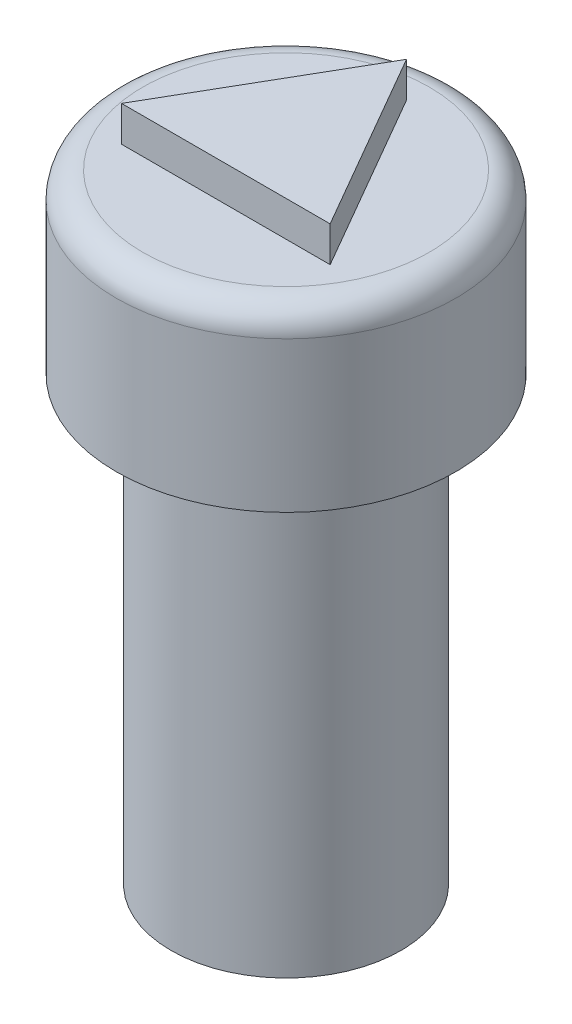
ISO-10303-21;
HEADER;
FILE_DESCRIPTION(('STEP AP214'),'2;1');
FILE_NAME('part.step','',(''),(''),'','','');
FILE_SCHEMA(('AUTOMOTIVE_DESIGN { 1 0 10303 214 1 1 1 1 }'));
ENDSEC;
DATA;
#1=APPLICATION_CONTEXT('core data for automotive mechanical design processes');
#2=APPLICATION_PROTOCOL_DEFINITION('international standard','automotive_design',2000,#1);
#3=PRODUCT_CONTEXT('',#1,'mechanical');
#4=PRODUCT('Part','Part','',(#3));
#5=PRODUCT_RELATED_PRODUCT_CATEGORY('part','',(#4));
#6=PRODUCT_DEFINITION_FORMATION('','',#4);
#7=PRODUCT_DEFINITION_CONTEXT('part definition',#1,'design');
#8=PRODUCT_DEFINITION('design','',#6,#7);
#9=PRODUCT_DEFINITION_SHAPE('','',#8);
#10=(LENGTH_UNIT() NAMED_UNIT(*) SI_UNIT(.MILLI.,.METRE.));
#11=(NAMED_UNIT(*) PLANE_ANGLE_UNIT() SI_UNIT($,.RADIAN.));
#12=(NAMED_UNIT(*) SI_UNIT($,.STERADIAN.) SOLID_ANGLE_UNIT());
#13=UNCERTAINTY_MEASURE_WITH_UNIT(LENGTH_MEASURE(1.E-05),#10,'distance_accuracy_value','');
#14=(GEOMETRIC_REPRESENTATION_CONTEXT(3) GLOBAL_UNCERTAINTY_ASSIGNED_CONTEXT((#13)) GLOBAL_UNIT_ASSIGNED_CONTEXT((#10,
#11,#12)) REPRESENTATION_CONTEXT('',''));
#15=CARTESIAN_POINT('',(0.,0.,0.));
#16=DIRECTION('',(0.,0.,1.));
#17=DIRECTION('',(1.,0.,0.));
#18=AXIS2_PLACEMENT_3D('',#15,#16,#17);
#19=CARTESIAN_POINT('',(0.,12.5,0.));
#20=DIRECTION('',(0.,-1.,0.));
#21=DIRECTION('',(0.,0.,-1.));
#22=AXIS2_PLACEMENT_3D('',#19,#20,#21);
#23=CYLINDRICAL_SURFACE('',#22,3.25);
#24=CARTESIAN_POINT('',(0.,12.5,0.));
#25=DIRECTION('',(0.,1.,0.));
#26=DIRECTION('',(0.,0.,1.));
#27=AXIS2_PLACEMENT_3D('',#24,#25,#26);
#28=CIRCLE('',#27,3.25);
#29=CARTESIAN_POINT('',(0.,12.5,3.25));
#30=VERTEX_POINT('',#29);
#31=EDGE_CURVE('E159',#30,#30,#28,.T.);
#32=ORIENTED_EDGE('',*,*,#31,.F.);
#33=EDGE_LOOP('',(#32));
#34=FACE_BOUND('',#33,.T.);
#35=CARTESIAN_POINT('',(0.,0.,0.));
#36=DIRECTION('',(0.,1.,0.));
#37=DIRECTION('',(0.,0.,1.));
#38=AXIS2_PLACEMENT_3D('',#35,#36,#37);
#39=CIRCLE('',#38,3.25);
#40=CARTESIAN_POINT('',(0.,0.,3.25));
#41=VERTEX_POINT('',#40);
#42=EDGE_CURVE('E155',#41,#41,#39,.T.);
#43=ORIENTED_EDGE('',*,*,#42,.T.);
#44=EDGE_LOOP('',(#43));
#45=FACE_BOUND('',#44,.T.);
#46=ADVANCED_FACE('F83',(#34,#45),#23,.T.);
#47=CARTESIAN_POINT('',(0.,0.,0.));
#48=DIRECTION('',(0.,1.,0.));
#49=DIRECTION('',(0.,0.,1.));
#50=AXIS2_PLACEMENT_3D('',#47,#48,#49);
#51=PLANE('',#50);
#52=CARTESIAN_POINT('',(0.,0.,0.));
#53=DIRECTION('',(0.,-1.,0.));
#54=DIRECTION('',(0.,0.,-1.));
#55=AXIS2_PLACEMENT_3D('',#52,#53,#54);
#56=CIRCLE('',#55,1.75);
#57=CARTESIAN_POINT('',(0.,0.,-1.75));
#58=VERTEX_POINT('',#57);
#59=EDGE_CURVE('E145',#58,#58,#56,.T.);
#60=ORIENTED_EDGE('',*,*,#59,.F.);
#61=EDGE_LOOP('',(#60));
#62=FACE_BOUND('',#61,.T.);
#63=ORIENTED_EDGE('',*,*,#42,.F.);
#64=EDGE_LOOP('',(#63));
#65=FACE_BOUND('',#64,.T.);
#66=ADVANCED_FACE('F181',(#62,#65),#51,.F.);
#67=CARTESIAN_POINT('',(0.,2.5,0.));
#68=DIRECTION('',(0.,-1.,0.));
#69=DIRECTION('',(0.,0.,-1.));
#70=AXIS2_PLACEMENT_3D('',#67,#68,#69);
#71=CYLINDRICAL_SURFACE('',#70,1.75);
#72=CARTESIAN_POINT('',(0.,2.5,0.));
#73=DIRECTION('',(0.,-1.,0.));
#74=DIRECTION('',(0.,0.,-1.));
#75=AXIS2_PLACEMENT_3D('',#72,#73,#74);
#76=CIRCLE('',#75,1.75);
#77=CARTESIAN_POINT('',(0.,2.5,-1.75));
#78=VERTEX_POINT('',#77);
#79=EDGE_CURVE('E151',#78,#78,#76,.T.);
#80=ORIENTED_EDGE('',*,*,#79,.F.);
#81=EDGE_LOOP('',(#80));
#82=FACE_BOUND('',#81,.T.);
#83=ORIENTED_EDGE('',*,*,#59,.T.);
#84=EDGE_LOOP('',(#83));
#85=FACE_BOUND('',#84,.T.);
#86=ADVANCED_FACE('F186',(#82,#85),#71,.F.);
#87=CARTESIAN_POINT('',(0.,2.5,0.));
#88=DIRECTION('',(0.,-1.,0.));
#89=DIRECTION('',(0.,0.,-1.));
#90=AXIS2_PLACEMENT_3D('',#87,#88,#89);
#91=PLANE('',#90);
#92=ORIENTED_EDGE('',*,*,#79,.T.);
#93=EDGE_LOOP('',(#92));
#94=FACE_BOUND('',#93,.T.);
#95=ADVANCED_FACE('F194',(#94),#91,.T.);
#96=CARTESIAN_POINT('',(0.,17.5,0.));
#97=DIRECTION('',(0.,-1.,0.));
#98=DIRECTION('',(0.,0.,-1.));
#99=AXIS2_PLACEMENT_3D('',#96,#97,#98);
#100=CYLINDRICAL_SURFACE('',#99,4.8);
#101=CARTESIAN_POINT('',(0.,16.75,0.));
#102=DIRECTION('',(0.,1.,0.));
#103=DIRECTION('',(0.,0.,1.));
#104=AXIS2_PLACEMENT_3D('',#101,#102,#103);
#105=CIRCLE('',#104,4.8);
#106=CARTESIAN_POINT('',(0.,16.75,4.8));
#107=VERTEX_POINT('',#106);
#108=EDGE_CURVE('E12',#107,#107,#105,.F.);
#109=ORIENTED_EDGE('',*,*,#108,.T.);
#110=EDGE_LOOP('',(#109));
#111=FACE_BOUND('',#110,.T.);
#112=CARTESIAN_POINT('',(0.,12.5,0.));
#113=DIRECTION('',(0.,1.,0.));
#114=DIRECTION('',(0.,0.,1.));
#115=AXIS2_PLACEMENT_3D('',#112,#113,#114);
#116=CIRCLE('',#115,4.8);
#117=CARTESIAN_POINT('',(0.,12.5,4.8));
#118=VERTEX_POINT('',#117);
#119=EDGE_CURVE('E140',#118,#118,#116,.T.);
#120=ORIENTED_EDGE('',*,*,#119,.T.);
#121=EDGE_LOOP('',(#120));
#122=FACE_BOUND('',#121,.T.);
#123=ADVANCED_FACE('F198',(#111,#122),#100,.T.);
#124=CARTESIAN_POINT('',(0.,17.5,0.));
#125=DIRECTION('',(0.,1.,0.));
#126=DIRECTION('',(0.,0.,1.));
#127=AXIS2_PLACEMENT_3D('',#124,#125,#126);
#128=PLANE('',#127);
#129=CARTESIAN_POINT('',(0.,17.5,0.));
#130=DIRECTION('',(0.,1.,0.));
#131=DIRECTION('',(0.,0.,1.));
#132=AXIS2_PLACEMENT_3D('',#129,#130,#131);
#133=CIRCLE('',#132,4.05);
#134=CARTESIAN_POINT('',(0.,17.5,4.05));
#135=VERTEX_POINT('',#134);
#136=EDGE_CURVE('E92',#135,#135,#133,.T.);
#137=ORIENTED_EDGE('',*,*,#136,.T.);
#138=EDGE_LOOP('',(#137));
#139=FACE_BOUND('',#138,.T.);
#140=DIRECTION('',(1.,0.,0.));
#141=VECTOR('',#140,1.);
#142=CARTESIAN_POINT('',(-2.95,17.5,1.7031832941094));
#143=LINE('',#142,#141);
#144=CARTESIAN_POINT('',(-2.95,17.5,1.7031832941094));
#145=VERTEX_POINT('',#144);
#146=CARTESIAN_POINT('',(2.95,17.5,1.7031832941094));
#147=VERTEX_POINT('',#146);
#148=EDGE_CURVE('E99',#145,#147,#143,.T.);
#149=ORIENTED_EDGE('',*,*,#148,.F.);
#150=DIRECTION('',(-0.500000000000001,0.,0.866025403784438));
#151=VECTOR('',#150,1.);
#152=CARTESIAN_POINT('',(0.,17.5,-3.40636658821879));
#153=LINE('',#152,#151);
#154=CARTESIAN_POINT('',(0.,17.5,-3.40636658821879));
#155=VERTEX_POINT('',#154);
#156=EDGE_CURVE('E136',#155,#145,#153,.T.);
#157=ORIENTED_EDGE('',*,*,#156,.F.);
#158=DIRECTION('',(-0.499999999999999,0.,-0.866025403784439));
#159=VECTOR('',#158,1.);
#160=CARTESIAN_POINT('',(2.95,17.5,1.7031832941094));
#161=LINE('',#160,#159);
#162=EDGE_CURVE('E103',#147,#155,#161,.T.);
#163=ORIENTED_EDGE('',*,*,#162,.F.);
#164=EDGE_LOOP('',(#149,#157,#163));
#165=FACE_BOUND('',#164,.T.);
#166=ADVANCED_FACE('F169',(#139,#165),#128,.T.);
#167=CARTESIAN_POINT('',(0.,12.5,0.));
#168=DIRECTION('',(0.,1.,0.));
#169=DIRECTION('',(0.,0.,1.));
#170=AXIS2_PLACEMENT_3D('',#167,#168,#169);
#171=PLANE('',#170);
#172=ORIENTED_EDGE('',*,*,#31,.T.);
#173=EDGE_LOOP('',(#172));
#174=FACE_BOUND('',#173,.T.);
#175=ORIENTED_EDGE('',*,*,#119,.F.);
#176=EDGE_LOOP('',(#175));
#177=FACE_BOUND('',#176,.T.);
#178=ADVANCED_FACE('F203',(#174,#177),#171,.F.);
#179=CARTESIAN_POINT('',(-2.95,18.5,1.7031832941094));
#180=DIRECTION('',(0.,0.,-1.));
#181=DIRECTION('',(-1.,0.,0.));
#182=AXIS2_PLACEMENT_3D('',#179,#180,#181);
#183=PLANE('',#182);
#184=ORIENTED_EDGE('',*,*,#148,.T.);
#185=DIRECTION('',(0.,-1.,0.));
#186=VECTOR('',#185,1.);
#187=CARTESIAN_POINT('',(2.95,18.5,1.7031832941094));
#188=LINE('',#187,#186);
#189=CARTESIAN_POINT('',(2.95,18.5,1.7031832941094));
#190=VERTEX_POINT('',#189);
#191=EDGE_CURVE('E121',#190,#147,#188,.T.);
#192=ORIENTED_EDGE('',*,*,#191,.F.);
#193=DIRECTION('',(1.,0.,0.));
#194=VECTOR('',#193,1.);
#195=CARTESIAN_POINT('',(-2.95,18.5,1.7031832941094));
#196=LINE('',#195,#194);
#197=CARTESIAN_POINT('',(-2.95,18.5,1.7031832941094));
#198=VERTEX_POINT('',#197);
#199=EDGE_CURVE('E128',#198,#190,#196,.T.);
#200=ORIENTED_EDGE('',*,*,#199,.F.);
#201=DIRECTION('',(0.,-1.,0.));
#202=VECTOR('',#201,1.);
#203=CARTESIAN_POINT('',(-2.95,18.5,1.7031832941094));
#204=LINE('',#203,#202);
#205=EDGE_CURVE('E147',#198,#145,#204,.T.);
#206=ORIENTED_EDGE('',*,*,#205,.T.);
#207=EDGE_LOOP('',(#184,#192,#200,#206));
#208=FACE_BOUND('',#207,.T.);
#209=ADVANCED_FACE('F138',(#208),#183,.F.);
#210=CARTESIAN_POINT('',(2.95,18.5,1.7031832941094));
#211=DIRECTION('',(-0.866025403784439,0.,0.5));
#212=DIRECTION('',(0.5,0.,0.866025403784439));
#213=AXIS2_PLACEMENT_3D('',#210,#211,#212);
#214=PLANE('',#213);
#215=ORIENTED_EDGE('',*,*,#162,.T.);
#216=DIRECTION('',(0.,-1.,0.));
#217=VECTOR('',#216,1.);
#218=CARTESIAN_POINT('',(0.,18.5,-3.40636658821879));
#219=LINE('',#218,#217);
#220=CARTESIAN_POINT('',(0.,18.5,-3.40636658821879));
#221=VERTEX_POINT('',#220);
#222=EDGE_CURVE('E123',#221,#155,#219,.T.);
#223=ORIENTED_EDGE('',*,*,#222,.F.);
#224=DIRECTION('',(-0.499999999999999,0.,-0.866025403784439));
#225=VECTOR('',#224,1.);
#226=CARTESIAN_POINT('',(2.95,18.5,1.7031832941094));
#227=LINE('',#226,#225);
#228=EDGE_CURVE('E117',#190,#221,#227,.T.);
#229=ORIENTED_EDGE('',*,*,#228,.F.);
#230=ORIENTED_EDGE('',*,*,#191,.T.);
#231=EDGE_LOOP('',(#215,#223,#229,#230));
#232=FACE_BOUND('',#231,.T.);
#233=ADVANCED_FACE('F119',(#232),#214,.F.);
#234=CARTESIAN_POINT('',(0.,18.5,-3.40636658821879));
#235=DIRECTION('',(0.866025403784438,0.,0.500000000000001));
#236=DIRECTION('',(0.500000000000001,0.,-0.866025403784438));
#237=AXIS2_PLACEMENT_3D('',#234,#235,#236);
#238=PLANE('',#237);
#239=ORIENTED_EDGE('',*,*,#156,.T.);
#240=ORIENTED_EDGE('',*,*,#205,.F.);
#241=DIRECTION('',(-0.500000000000001,0.,0.866025403784438));
#242=VECTOR('',#241,1.);
#243=CARTESIAN_POINT('',(0.,18.5,-3.40636658821879));
#244=LINE('',#243,#242);
#245=EDGE_CURVE('E127',#221,#198,#244,.T.);
#246=ORIENTED_EDGE('',*,*,#245,.F.);
#247=ORIENTED_EDGE('',*,*,#222,.T.);
#248=EDGE_LOOP('',(#239,#240,#246,#247));
#249=FACE_BOUND('',#248,.T.);
#250=ADVANCED_FACE('F177',(#249),#238,.F.);
#251=CARTESIAN_POINT('',(0.,18.5,0.));
#252=DIRECTION('',(0.,1.,0.));
#253=DIRECTION('',(0.,0.,1.));
#254=AXIS2_PLACEMENT_3D('',#251,#252,#253);
#255=PLANE('',#254);
#256=ORIENTED_EDGE('',*,*,#199,.T.);
#257=ORIENTED_EDGE('',*,*,#228,.T.);
#258=ORIENTED_EDGE('',*,*,#245,.T.);
#259=EDGE_LOOP('',(#256,#257,#258));
#260=FACE_BOUND('',#259,.T.);
#261=ADVANCED_FACE('F131',(#260),#255,.T.);
#262=CARTESIAN_POINT('',(0.,16.75,0.));
#263=DIRECTION('',(0.,1.,0.));
#264=DIRECTION('',(0.,0.,1.));
#265=AXIS2_PLACEMENT_3D('',#262,#263,#264);
#266=TOROIDAL_SURFACE('',#265,4.05,0.75);
#267=ORIENTED_EDGE('',*,*,#108,.F.);
#268=EDGE_LOOP('',(#267));
#269=FACE_BOUND('',#268,.T.);
#270=ORIENTED_EDGE('',*,*,#136,.F.);
#271=EDGE_LOOP('',(#270));
#272=FACE_BOUND('',#271,.T.);
#273=ADVANCED_FACE('F85',(#269,#272),#266,.T.);
#274=CLOSED_SHELL('',(#46,#66,#86,#95,#123,#166,#178,#209,#233,#250,#261,#273));
#275=MANIFOLD_SOLID_BREP('B2',#274);
#276=ADVANCED_BREP_SHAPE_REPRESENTATION('',(#18,#275),#14);
#277=SHAPE_DEFINITION_REPRESENTATION(#9,#276);
ENDSEC;
END-ISO-10303-21;
